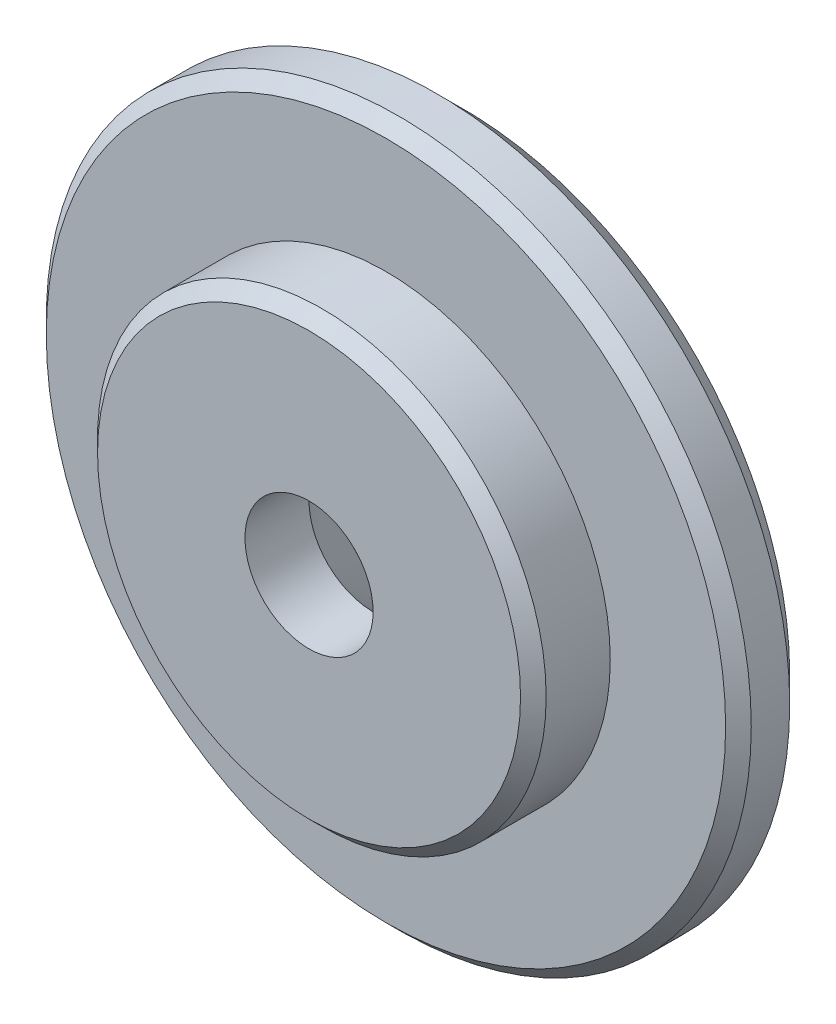
ISO-10303-21;
HEADER;
FILE_DESCRIPTION(('STEP AP214'),'2;1');
FILE_NAME('part.step','',(''),(''),'','','');
FILE_SCHEMA(('AUTOMOTIVE_DESIGN { 1 0 10303 214 1 1 1 1 }'));
ENDSEC;
DATA;
#1=APPLICATION_CONTEXT('core data for automotive mechanical design processes');
#2=APPLICATION_PROTOCOL_DEFINITION('international standard','automotive_design',2000,#1);
#3=PRODUCT_CONTEXT('',#1,'mechanical');
#4=PRODUCT('Part','Part','',(#3));
#5=PRODUCT_RELATED_PRODUCT_CATEGORY('part','',(#4));
#6=PRODUCT_DEFINITION_FORMATION('','',#4);
#7=PRODUCT_DEFINITION_CONTEXT('part definition',#1,'design');
#8=PRODUCT_DEFINITION('design','',#6,#7);
#9=PRODUCT_DEFINITION_SHAPE('','',#8);
#10=(LENGTH_UNIT() NAMED_UNIT(*) SI_UNIT(.MILLI.,.METRE.));
#11=(NAMED_UNIT(*) PLANE_ANGLE_UNIT() SI_UNIT($,.RADIAN.));
#12=(NAMED_UNIT(*) SI_UNIT($,.STERADIAN.) SOLID_ANGLE_UNIT());
#13=UNCERTAINTY_MEASURE_WITH_UNIT(LENGTH_MEASURE(1.E-05),#10,'distance_accuracy_value','');
#14=(GEOMETRIC_REPRESENTATION_CONTEXT(3) GLOBAL_UNCERTAINTY_ASSIGNED_CONTEXT((#13)) GLOBAL_UNIT_ASSIGNED_CONTEXT((#10,
#11,#12)) REPRESENTATION_CONTEXT('',''));
#15=CARTESIAN_POINT('',(0.,0.,0.));
#16=DIRECTION('',(0.,0.,1.));
#17=DIRECTION('',(1.,0.,0.));
#18=AXIS2_PLACEMENT_3D('',#15,#16,#17);
#19=CARTESIAN_POINT('',(0.0121477153514696,0.,0.));
#20=DIRECTION('',(0.,0.,1.));
#21=DIRECTION('',(1.,0.,0.));
#22=AXIS2_PLACEMENT_3D('',#19,#20,#21);
#23=CYLINDRICAL_SURFACE('',#22,17.4999955455329);
#24=CARTESIAN_POINT('',(0.0121477153514704,0.,10.969981855205));
#25=DIRECTION('',(0.,0.,1.));
#26=DIRECTION('',(1.,0.,0.));
#27=AXIS2_PLACEMENT_3D('',#24,#25,#26);
#28=CIRCLE('',#27,17.4999955455329);
#29=CARTESIAN_POINT('',(17.5121432608843,0.,10.969981855205));
#30=VERTEX_POINT('',#29);
#31=EDGE_CURVE('E43',#30,#30,#28,.F.);
#32=ORIENTED_EDGE('',*,*,#31,.T.);
#33=EDGE_LOOP('',(#32));
#34=FACE_BOUND('',#33,.T.);
#35=CARTESIAN_POINT('',(0.01214771535147,0.,5.96998185520496));
#36=DIRECTION('',(0.,0.,1.));
#37=DIRECTION('',(1.,0.,0.));
#38=AXIS2_PLACEMENT_3D('',#35,#36,#37);
#39=CIRCLE('',#38,17.4999955455329);
#40=CARTESIAN_POINT('',(17.5121432608843,0.,5.96998185520496));
#41=VERTEX_POINT('',#40);
#42=EDGE_CURVE('E67',#41,#41,#39,.T.);
#43=ORIENTED_EDGE('',*,*,#42,.T.);
#44=EDGE_LOOP('',(#43));
#45=FACE_BOUND('',#44,.T.);
#46=ADVANCED_FACE('F32',(#34,#45),#23,.T.);
#47=CARTESIAN_POINT('',(5.01214771535147,0.,11.969981855205));
#48=DIRECTION('',(0.,0.,1.));
#49=DIRECTION('',(1.,0.,0.));
#50=AXIS2_PLACEMENT_3D('',#47,#48,#49);
#51=PLANE('',#50);
#52=CARTESIAN_POINT('',(0.0121477153514704,0.,11.969981855205));
#53=DIRECTION('',(0.,0.,1.));
#54=DIRECTION('',(1.,0.,0.));
#55=AXIS2_PLACEMENT_3D('',#52,#53,#54);
#56=CIRCLE('',#55,16.4999955455329);
#57=CARTESIAN_POINT('',(16.5121432608843,0.,11.969981855205));
#58=VERTEX_POINT('',#57);
#59=EDGE_CURVE('E47',#58,#58,#56,.T.);
#60=ORIENTED_EDGE('',*,*,#59,.T.);
#61=EDGE_LOOP('',(#60));
#62=FACE_BOUND('',#61,.T.);
#63=CARTESIAN_POINT('',(0.0121477153514704,0.,11.969981855205));
#64=DIRECTION('',(0.,0.,1.));
#65=DIRECTION('',(1.,0.,0.));
#66=AXIS2_PLACEMENT_3D('',#63,#64,#65);
#67=CIRCLE('',#66,5.);
#68=CARTESIAN_POINT('',(5.01214771535147,0.,11.969981855205));
#69=VERTEX_POINT('',#68);
#70=EDGE_CURVE('E58',#69,#69,#67,.T.);
#71=ORIENTED_EDGE('',*,*,#70,.F.);
#72=EDGE_LOOP('',(#71));
#73=FACE_BOUND('',#72,.T.);
#74=ADVANCED_FACE('F87',(#62,#73),#51,.T.);
#75=CARTESIAN_POINT('',(0.0121477153514696,0.,0.));
#76=DIRECTION('',(0.,0.,1.));
#77=DIRECTION('',(1.,0.,0.));
#78=AXIS2_PLACEMENT_3D('',#75,#76,#77);
#79=CYLINDRICAL_SURFACE('',#78,5.);
#80=ORIENTED_EDGE('',*,*,#70,.T.);
#81=EDGE_LOOP('',(#80));
#82=FACE_BOUND('',#81,.T.);
#83=CARTESIAN_POINT('',(0.0121477153514701,0.,6.96998185520496));
#84=DIRECTION('',(0.,0.,1.));
#85=DIRECTION('',(1.,0.,0.));
#86=AXIS2_PLACEMENT_3D('',#83,#84,#85);
#87=CIRCLE('',#86,5.);
#88=CARTESIAN_POINT('',(5.01214771535147,0.,6.96998185520496));
#89=VERTEX_POINT('',#88);
#90=EDGE_CURVE('E61',#89,#89,#87,.T.);
#91=ORIENTED_EDGE('',*,*,#90,.F.);
#92=EDGE_LOOP('',(#91));
#93=FACE_BOUND('',#92,.T.);
#94=ADVANCED_FACE('F93',(#82,#93),#79,.F.);
#95=CARTESIAN_POINT('',(0.0121477153514696,0.,-0.030018144795041));
#96=DIRECTION('',(0.,0.,-1.));
#97=DIRECTION('',(-1.,0.,0.));
#98=AXIS2_PLACEMENT_3D('',#95,#96,#97);
#99=CONICAL_SURFACE('',#98,12.,0.78539816339745);
#100=ORIENTED_EDGE('',*,*,#90,.T.);
#101=EDGE_LOOP('',(#100));
#102=FACE_BOUND('',#101,.T.);
#103=CARTESIAN_POINT('',(0.0121477153514696,0.,-0.030018144795041));
#104=DIRECTION('',(0.,0.,1.));
#105=DIRECTION('',(1.,0.,0.));
#106=AXIS2_PLACEMENT_3D('',#103,#104,#105);
#107=CIRCLE('',#106,12.);
#108=CARTESIAN_POINT('',(12.0121477153515,0.,-0.0300181447950418));
#109=VERTEX_POINT('',#108);
#110=EDGE_CURVE('E64',#109,#109,#107,.T.);
#111=ORIENTED_EDGE('',*,*,#110,.F.);
#112=EDGE_LOOP('',(#111));
#113=FACE_BOUND('',#112,.T.);
#114=ADVANCED_FACE('F111',(#102,#113),#99,.F.);
#115=CARTESIAN_POINT('',(27.5121477250159,0.,-0.0300181447950433));
#116=DIRECTION('',(0.,0.,-1.));
#117=DIRECTION('',(-1.,0.,0.));
#118=AXIS2_PLACEMENT_3D('',#115,#116,#117);
#119=PLANE('',#118);
#120=CARTESIAN_POINT('',(0.0121477153514696,0.,-0.0300181447950413));
#121=DIRECTION('',(0.,0.,-1.));
#122=DIRECTION('',(-1.,0.,0.));
#123=AXIS2_PLACEMENT_3D('',#120,#121,#122);
#124=CIRCLE('',#123,25.5000000096644);
#125=CARTESIAN_POINT('',(-25.487852294313,0.,-0.0300181447950395));
#126=VERTEX_POINT('',#125);
#127=EDGE_CURVE('E52',#126,#126,#124,.T.);
#128=ORIENTED_EDGE('',*,*,#127,.T.);
#129=EDGE_LOOP('',(#128));
#130=FACE_BOUND('',#129,.T.);
#131=ORIENTED_EDGE('',*,*,#110,.T.);
#132=EDGE_LOOP('',(#131));
#133=FACE_BOUND('',#132,.T.);
#134=ADVANCED_FACE('F84',(#130,#133),#119,.T.);
#135=CARTESIAN_POINT('',(0.0121477153514696,0.,0.));
#136=DIRECTION('',(0.,0.,1.));
#137=DIRECTION('',(1.,0.,0.));
#138=AXIS2_PLACEMENT_3D('',#135,#136,#137);
#139=CYLINDRICAL_SURFACE('',#138,27.5000000096644);
#140=CARTESIAN_POINT('',(0.0121477153514699,0.,4.96998185520494));
#141=DIRECTION('',(0.,0.,1.));
#142=DIRECTION('',(1.,0.,0.));
#143=AXIS2_PLACEMENT_3D('',#140,#141,#142);
#144=CIRCLE('',#143,27.5000000096644);
#145=CARTESIAN_POINT('',(27.5121477250159,0.,4.96998185520494));
#146=VERTEX_POINT('',#145);
#147=EDGE_CURVE('E10',#146,#146,#144,.F.);
#148=ORIENTED_EDGE('',*,*,#147,.T.);
#149=EDGE_LOOP('',(#148));
#150=FACE_BOUND('',#149,.T.);
#151=CARTESIAN_POINT('',(0.0121477153514697,0.,1.96998185520495));
#152=DIRECTION('',(0.,0.,-1.));
#153=DIRECTION('',(-1.,0.,0.));
#154=AXIS2_PLACEMENT_3D('',#151,#152,#153);
#155=CIRCLE('',#154,27.5000000096644);
#156=CARTESIAN_POINT('',(-27.487852294313,0.,1.96998185520496));
#157=VERTEX_POINT('',#156);
#158=EDGE_CURVE('E55',#157,#157,#155,.F.);
#159=ORIENTED_EDGE('',*,*,#158,.T.);
#160=EDGE_LOOP('',(#159));
#161=FACE_BOUND('',#160,.T.);
#162=ADVANCED_FACE('F75',(#150,#161),#139,.T.);
#163=CARTESIAN_POINT('',(17.5121432608843,0.,5.96998185520496));
#164=DIRECTION('',(0.,0.,1.));
#165=DIRECTION('',(1.,0.,0.));
#166=AXIS2_PLACEMENT_3D('',#163,#164,#165);
#167=PLANE('',#166);
#168=CARTESIAN_POINT('',(0.01214771535147,0.,5.96998185520496));
#169=DIRECTION('',(0.,0.,1.));
#170=DIRECTION('',(1.,0.,0.));
#171=AXIS2_PLACEMENT_3D('',#168,#169,#170);
#172=CIRCLE('',#171,26.5000000096644);
#173=CARTESIAN_POINT('',(26.5121477250159,0.,5.96998185520495));
#174=VERTEX_POINT('',#173);
#175=EDGE_CURVE('E39',#174,#174,#172,.T.);
#176=ORIENTED_EDGE('',*,*,#175,.T.);
#177=EDGE_LOOP('',(#176));
#178=FACE_BOUND('',#177,.T.);
#179=ORIENTED_EDGE('',*,*,#42,.F.);
#180=EDGE_LOOP('',(#179));
#181=FACE_BOUND('',#180,.T.);
#182=ADVANCED_FACE('F72',(#178,#181),#167,.T.);
#183=CARTESIAN_POINT('',(0.0121477153514697,0.,1.96998185520495));
#184=DIRECTION('',(0.,0.,1.));
#185=DIRECTION('',(1.,0.,0.));
#186=AXIS2_PLACEMENT_3D('',#183,#184,#185);
#187=CONICAL_SURFACE('',#186,27.5000000096644,0.78539816339745);
#188=ORIENTED_EDGE('',*,*,#127,.F.);
#189=EDGE_LOOP('',(#188));
#190=FACE_BOUND('',#189,.T.);
#191=ORIENTED_EDGE('',*,*,#158,.F.);
#192=EDGE_LOOP('',(#191));
#193=FACE_BOUND('',#192,.T.);
#194=ADVANCED_FACE('F74',(#190,#193),#187,.T.);
#195=CARTESIAN_POINT('',(0.0121477153514704,0.,11.969981855205));
#196=DIRECTION('',(0.,0.,-1.));
#197=DIRECTION('',(-1.,0.,0.));
#198=AXIS2_PLACEMENT_3D('',#195,#196,#197);
#199=CONICAL_SURFACE('',#198,16.4999955455329,0.785398163397447);
#200=ORIENTED_EDGE('',*,*,#31,.F.);
#201=EDGE_LOOP('',(#200));
#202=FACE_BOUND('',#201,.T.);
#203=ORIENTED_EDGE('',*,*,#59,.F.);
#204=EDGE_LOOP('',(#203));
#205=FACE_BOUND('',#204,.T.);
#206=ADVANCED_FACE('F81',(#202,#205),#199,.T.);
#207=CARTESIAN_POINT('',(0.01214771535147,0.,5.96998185520496));
#208=DIRECTION('',(0.,0.,-1.));
#209=DIRECTION('',(-1.,0.,0.));
#210=AXIS2_PLACEMENT_3D('',#207,#208,#209);
#211=CONICAL_SURFACE('',#210,26.5000000096644,0.78539816339745);
#212=ORIENTED_EDGE('',*,*,#147,.F.);
#213=EDGE_LOOP('',(#212));
#214=FACE_BOUND('',#213,.T.);
#215=ORIENTED_EDGE('',*,*,#175,.F.);
#216=EDGE_LOOP('',(#215));
#217=FACE_BOUND('',#216,.T.);
#218=ADVANCED_FACE('F34',(#214,#217),#211,.T.);
#219=CLOSED_SHELL('',(#46,#74,#94,#114,#134,#162,#182,#194,#206,#218));
#220=MANIFOLD_SOLID_BREP('B2',#219);
#221=ADVANCED_BREP_SHAPE_REPRESENTATION('',(#18,#220),#14);
#222=SHAPE_DEFINITION_REPRESENTATION(#9,#221);
ENDSEC;
END-ISO-10303-21;
